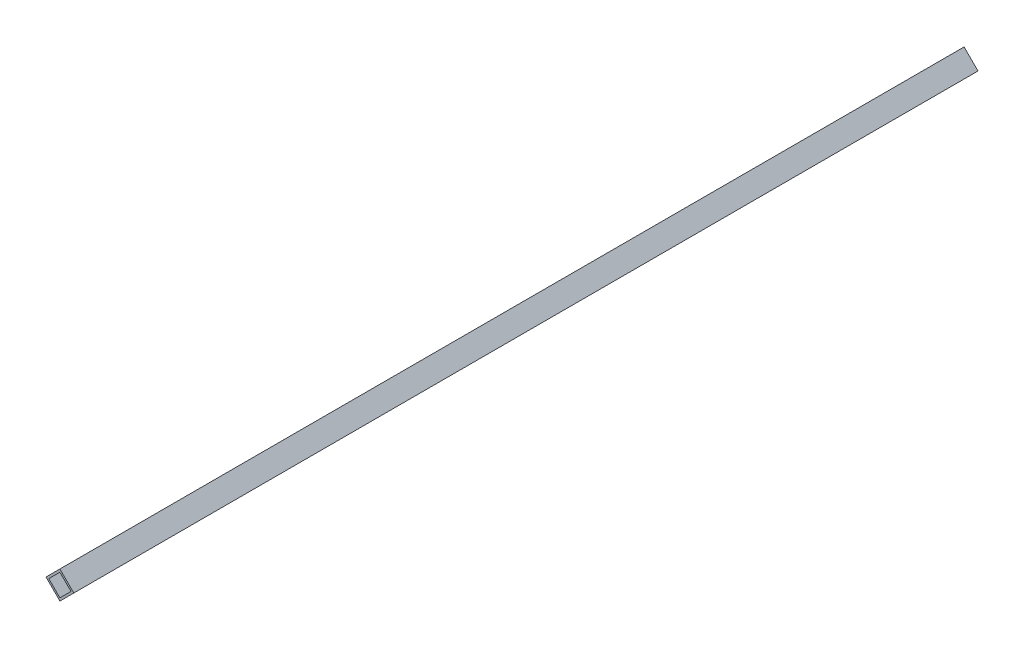
ISO-10303-21;
HEADER;
FILE_DESCRIPTION(('STEP AP214'),'2;1');
FILE_NAME('part.step','',(''),(''),'','','');
FILE_SCHEMA(('AUTOMOTIVE_DESIGN { 1 0 10303 214 1 1 1 1 }'));
ENDSEC;
DATA;
#1=APPLICATION_CONTEXT('core data for automotive mechanical design processes');
#2=APPLICATION_PROTOCOL_DEFINITION('international standard','automotive_design',2000,#1);
#3=PRODUCT_CONTEXT('',#1,'mechanical');
#4=PRODUCT('Part','Part','',(#3));
#5=PRODUCT_RELATED_PRODUCT_CATEGORY('part','',(#4));
#6=PRODUCT_DEFINITION_FORMATION('','',#4);
#7=PRODUCT_DEFINITION_CONTEXT('part definition',#1,'design');
#8=PRODUCT_DEFINITION('design','',#6,#7);
#9=PRODUCT_DEFINITION_SHAPE('','',#8);
#10=(LENGTH_UNIT() NAMED_UNIT(*) SI_UNIT(.MILLI.,.METRE.));
#11=(NAMED_UNIT(*) PLANE_ANGLE_UNIT() SI_UNIT($,.RADIAN.));
#12=(NAMED_UNIT(*) SI_UNIT($,.STERADIAN.) SOLID_ANGLE_UNIT());
#13=UNCERTAINTY_MEASURE_WITH_UNIT(LENGTH_MEASURE(1.E-05),#10,'distance_accuracy_value','');
#14=(GEOMETRIC_REPRESENTATION_CONTEXT(3) GLOBAL_UNCERTAINTY_ASSIGNED_CONTEXT((#13)) GLOBAL_UNIT_ASSIGNED_CONTEXT((#10,
#11,#12)) REPRESENTATION_CONTEXT('',''));
#15=CARTESIAN_POINT('',(0.,0.,0.));
#16=DIRECTION('',(0.,0.,1.));
#17=DIRECTION('',(1.,0.,0.));
#18=AXIS2_PLACEMENT_3D('',#15,#16,#17);
#19=CARTESIAN_POINT('',(0.,0.,230.));
#20=DIRECTION('',(0.,0.,1.));
#21=DIRECTION('',(1.,0.,0.));
#22=AXIS2_PLACEMENT_3D('',#19,#20,#21);
#23=PLANE('',#22);
#24=DIRECTION('',(0.707106781186548,-0.707106781186547,0.));
#25=VECTOR('',#24,1.);
#26=CARTESIAN_POINT('',(-7.07106781186547,0.,230.));
#27=LINE('',#26,#25);
#28=CARTESIAN_POINT('',(-7.07106781186547,0.,230.));
#29=VERTEX_POINT('',#28);
#30=CARTESIAN_POINT('',(0.,-7.07106781186548,230.));
#31=VERTEX_POINT('',#30);
#32=EDGE_CURVE('E160',#29,#31,#27,.T.);
#33=ORIENTED_EDGE('',*,*,#32,.T.);
#34=DIRECTION('',(0.707106781186547,0.707106781186548,0.));
#35=VECTOR('',#34,1.);
#36=CARTESIAN_POINT('',(0.,-7.07106781186548,230.));
#37=LINE('',#36,#35);
#38=CARTESIAN_POINT('',(7.07106781186548,0.,230.));
#39=VERTEX_POINT('',#38);
#40=EDGE_CURVE('E163',#31,#39,#37,.T.);
#41=ORIENTED_EDGE('',*,*,#40,.T.);
#42=DIRECTION('',(-0.707106781186548,0.707106781186547,0.));
#43=VECTOR('',#42,1.);
#44=CARTESIAN_POINT('',(7.07106781186548,0.,230.));
#45=LINE('',#44,#43);
#46=CARTESIAN_POINT('',(0.,7.07106781186548,230.));
#47=VERTEX_POINT('',#46);
#48=EDGE_CURVE('E166',#39,#47,#45,.T.);
#49=ORIENTED_EDGE('',*,*,#48,.T.);
#50=DIRECTION('',(-0.707106781186547,-0.707106781186548,0.));
#51=VECTOR('',#50,1.);
#52=CARTESIAN_POINT('',(0.,7.07106781186548,230.));
#53=LINE('',#52,#51);
#54=EDGE_CURVE('E168',#47,#29,#53,.T.);
#55=ORIENTED_EDGE('',*,*,#54,.T.);
#56=EDGE_LOOP('',(#33,#41,#49,#55));
#57=FACE_BOUND('',#56,.T.);
#58=DIRECTION('',(0.707106781186547,0.707106781186548,0.));
#59=VECTOR('',#58,1.);
#60=CARTESIAN_POINT('',(-0.707106781186546,-6.36396103067893,230.));
#61=LINE('',#60,#59);
#62=CARTESIAN_POINT('',(0.,-5.65685424949238,230.));
#63=VERTEX_POINT('',#62);
#64=CARTESIAN_POINT('',(5.65685424949238,0.,230.));
#65=VERTEX_POINT('',#64);
#66=EDGE_CURVE('E132',#63,#65,#61,.T.);
#67=ORIENTED_EDGE('',*,*,#66,.F.);
#68=DIRECTION('',(0.707106781186548,-0.707106781186547,0.));
#69=VECTOR('',#68,1.);
#70=CARTESIAN_POINT('',(-6.36396103067892,0.707106781186545,230.));
#71=LINE('',#70,#69);
#72=CARTESIAN_POINT('',(-5.65685424949238,0.,230.));
#73=VERTEX_POINT('',#72);
#74=EDGE_CURVE('E124',#73,#63,#71,.T.);
#75=ORIENTED_EDGE('',*,*,#74,.F.);
#76=DIRECTION('',(-0.707106781186547,-0.707106781186548,0.));
#77=VECTOR('',#76,1.);
#78=CARTESIAN_POINT('',(0.707106781186548,6.36396103067893,230.));
#79=LINE('',#78,#77);
#80=CARTESIAN_POINT('',(0.,5.65685424949238,230.));
#81=VERTEX_POINT('',#80);
#82=EDGE_CURVE('E146',#81,#73,#79,.T.);
#83=ORIENTED_EDGE('',*,*,#82,.F.);
#84=DIRECTION('',(-0.707106781186548,0.707106781186547,0.));
#85=VECTOR('',#84,1.);
#86=CARTESIAN_POINT('',(6.36396103067893,-0.707106781186545,230.));
#87=LINE('',#86,#85);
#88=EDGE_CURVE('E144',#65,#81,#87,.T.);
#89=ORIENTED_EDGE('',*,*,#88,.F.);
#90=EDGE_LOOP('',(#67,#75,#83,#89));
#91=FACE_BOUND('',#90,.T.);
#92=ADVANCED_FACE('F59',(#57,#91),#23,.T.);
#93=CARTESIAN_POINT('',(0.,0.,-230.));
#94=DIRECTION('',(0.,0.,1.));
#95=DIRECTION('',(1.,0.,0.));
#96=AXIS2_PLACEMENT_3D('',#93,#94,#95);
#97=PLANE('',#96);
#98=DIRECTION('',(0.707106781186548,-0.707106781186547,0.));
#99=VECTOR('',#98,1.);
#100=CARTESIAN_POINT('',(-7.07106781186547,0.,-230.));
#101=LINE('',#100,#99);
#102=CARTESIAN_POINT('',(-7.07106781186547,0.,-230.));
#103=VERTEX_POINT('',#102);
#104=CARTESIAN_POINT('',(0.,-7.07106781186548,-230.));
#105=VERTEX_POINT('',#104);
#106=EDGE_CURVE('E140',#103,#105,#101,.T.);
#107=ORIENTED_EDGE('',*,*,#106,.F.);
#108=DIRECTION('',(-0.707106781186547,-0.707106781186548,0.));
#109=VECTOR('',#108,1.);
#110=CARTESIAN_POINT('',(0.,7.07106781186548,-230.));
#111=LINE('',#110,#109);
#112=CARTESIAN_POINT('',(0.,7.07106781186548,-230.));
#113=VERTEX_POINT('',#112);
#114=EDGE_CURVE('E164',#113,#103,#111,.T.);
#115=ORIENTED_EDGE('',*,*,#114,.F.);
#116=DIRECTION('',(-0.707106781186548,0.707106781186547,0.));
#117=VECTOR('',#116,1.);
#118=CARTESIAN_POINT('',(7.07106781186548,0.,-230.));
#119=LINE('',#118,#117);
#120=CARTESIAN_POINT('',(7.07106781186548,0.,-230.));
#121=VERTEX_POINT('',#120);
#122=EDGE_CURVE('E175',#121,#113,#119,.T.);
#123=ORIENTED_EDGE('',*,*,#122,.F.);
#124=DIRECTION('',(0.707106781186547,0.707106781186548,0.));
#125=VECTOR('',#124,1.);
#126=CARTESIAN_POINT('',(0.,-7.07106781186548,-230.));
#127=LINE('',#126,#125);
#128=EDGE_CURVE('E173',#105,#121,#127,.T.);
#129=ORIENTED_EDGE('',*,*,#128,.F.);
#130=EDGE_LOOP('',(#107,#115,#123,#129));
#131=FACE_BOUND('',#130,.T.);
#132=DIRECTION('',(0.707106781186548,-0.707106781186547,0.));
#133=VECTOR('',#132,1.);
#134=CARTESIAN_POINT('',(-6.36396103067892,0.707106781186545,-230.));
#135=LINE('',#134,#133);
#136=CARTESIAN_POINT('',(-5.65685424949238,0.,-230.));
#137=VERTEX_POINT('',#136);
#138=CARTESIAN_POINT('',(0.,-5.65685424949238,-230.));
#139=VERTEX_POINT('',#138);
#140=EDGE_CURVE('E82',#137,#139,#135,.T.);
#141=ORIENTED_EDGE('',*,*,#140,.T.);
#142=DIRECTION('',(0.707106781186547,0.707106781186548,0.));
#143=VECTOR('',#142,1.);
#144=CARTESIAN_POINT('',(-0.707106781186546,-6.36396103067893,-230.));
#145=LINE('',#144,#143);
#146=CARTESIAN_POINT('',(5.65685424949238,0.,-230.));
#147=VERTEX_POINT('',#146);
#148=EDGE_CURVE('E139',#139,#147,#145,.T.);
#149=ORIENTED_EDGE('',*,*,#148,.T.);
#150=DIRECTION('',(-0.707106781186548,0.707106781186547,0.));
#151=VECTOR('',#150,1.);
#152=CARTESIAN_POINT('',(6.36396103067893,-0.707106781186545,-230.));
#153=LINE('',#152,#151);
#154=CARTESIAN_POINT('',(0.,5.65685424949238,-230.));
#155=VERTEX_POINT('',#154);
#156=EDGE_CURVE('E152',#147,#155,#153,.T.);
#157=ORIENTED_EDGE('',*,*,#156,.T.);
#158=DIRECTION('',(-0.707106781186547,-0.707106781186548,0.));
#159=VECTOR('',#158,1.);
#160=CARTESIAN_POINT('',(0.707106781186548,6.36396103067893,-230.));
#161=LINE('',#160,#159);
#162=EDGE_CURVE('E133',#155,#137,#161,.T.);
#163=ORIENTED_EDGE('',*,*,#162,.T.);
#164=EDGE_LOOP('',(#141,#149,#157,#163));
#165=FACE_BOUND('',#164,.T.);
#166=ADVANCED_FACE('F193',(#131,#165),#97,.F.);
#167=CARTESIAN_POINT('',(-7.07106781186547,0.,230.));
#168=DIRECTION('',(0.707106781186547,0.707106781186548,0.));
#169=DIRECTION('',(-0.707106781186548,0.707106781186547,0.));
#170=AXIS2_PLACEMENT_3D('',#167,#168,#169);
#171=PLANE('',#170);
#172=ORIENTED_EDGE('',*,*,#106,.T.);
#173=DIRECTION('',(0.,0.,-1.));
#174=VECTOR('',#173,1.);
#175=CARTESIAN_POINT('',(0.,-7.07106781186548,230.));
#176=LINE('',#175,#174);
#177=EDGE_CURVE('E12',#31,#105,#176,.T.);
#178=ORIENTED_EDGE('',*,*,#177,.F.);
#179=ORIENTED_EDGE('',*,*,#32,.F.);
#180=DIRECTION('',(0.,0.,-1.));
#181=VECTOR('',#180,1.);
#182=CARTESIAN_POINT('',(-7.07106781186547,0.,230.));
#183=LINE('',#182,#181);
#184=EDGE_CURVE('E170',#29,#103,#183,.T.);
#185=ORIENTED_EDGE('',*,*,#184,.T.);
#186=EDGE_LOOP('',(#172,#178,#179,#185));
#187=FACE_BOUND('',#186,.T.);
#188=ADVANCED_FACE('F61',(#187),#171,.F.);
#189=CARTESIAN_POINT('',(0.,-7.07106781186548,230.));
#190=DIRECTION('',(-0.707106781186548,0.707106781186547,0.));
#191=DIRECTION('',(-0.707106781186547,-0.707106781186548,0.));
#192=AXIS2_PLACEMENT_3D('',#189,#190,#191);
#193=PLANE('',#192);
#194=ORIENTED_EDGE('',*,*,#128,.T.);
#195=DIRECTION('',(0.,0.,-1.));
#196=VECTOR('',#195,1.);
#197=CARTESIAN_POINT('',(7.07106781186548,0.,230.));
#198=LINE('',#197,#196);
#199=EDGE_CURVE('E67',#39,#121,#198,.T.);
#200=ORIENTED_EDGE('',*,*,#199,.F.);
#201=ORIENTED_EDGE('',*,*,#40,.F.);
#202=ORIENTED_EDGE('',*,*,#177,.T.);
#203=EDGE_LOOP('',(#194,#200,#201,#202));
#204=FACE_BOUND('',#203,.T.);
#205=ADVANCED_FACE('F203',(#204),#193,.F.);
#206=CARTESIAN_POINT('',(7.07106781186548,0.,230.));
#207=DIRECTION('',(-0.707106781186547,-0.707106781186548,0.));
#208=DIRECTION('',(0.707106781186548,-0.707106781186547,0.));
#209=AXIS2_PLACEMENT_3D('',#206,#207,#208);
#210=PLANE('',#209);
#211=ORIENTED_EDGE('',*,*,#122,.T.);
#212=DIRECTION('',(0.,0.,-1.));
#213=VECTOR('',#212,1.);
#214=CARTESIAN_POINT('',(0.,7.07106781186548,230.));
#215=LINE('',#214,#213);
#216=EDGE_CURVE('E180',#47,#113,#215,.T.);
#217=ORIENTED_EDGE('',*,*,#216,.F.);
#218=ORIENTED_EDGE('',*,*,#48,.F.);
#219=ORIENTED_EDGE('',*,*,#199,.T.);
#220=EDGE_LOOP('',(#211,#217,#218,#219));
#221=FACE_BOUND('',#220,.T.);
#222=ADVANCED_FACE('F187',(#221),#210,.F.);
#223=CARTESIAN_POINT('',(0.,7.07106781186548,230.));
#224=DIRECTION('',(0.707106781186548,-0.707106781186547,0.));
#225=DIRECTION('',(0.707106781186547,0.707106781186548,0.));
#226=AXIS2_PLACEMENT_3D('',#223,#224,#225);
#227=PLANE('',#226);
#228=ORIENTED_EDGE('',*,*,#114,.T.);
#229=ORIENTED_EDGE('',*,*,#184,.F.);
#230=ORIENTED_EDGE('',*,*,#54,.F.);
#231=ORIENTED_EDGE('',*,*,#216,.T.);
#232=EDGE_LOOP('',(#228,#229,#230,#231));
#233=FACE_BOUND('',#232,.T.);
#234=ADVANCED_FACE('F197',(#233),#227,.F.);
#235=CARTESIAN_POINT('',(-6.36396103067892,0.707106781186545,230.));
#236=DIRECTION('',(0.707106781186547,0.707106781186548,0.));
#237=DIRECTION('',(-0.707106781186548,0.707106781186547,0.));
#238=AXIS2_PLACEMENT_3D('',#235,#236,#237);
#239=PLANE('',#238);
#240=ORIENTED_EDGE('',*,*,#140,.F.);
#241=DIRECTION('',(0.,0.,-1.));
#242=VECTOR('',#241,1.);
#243=CARTESIAN_POINT('',(-5.65685424949238,0.,230.));
#244=LINE('',#243,#242);
#245=EDGE_CURVE('E128',#73,#137,#244,.T.);
#246=ORIENTED_EDGE('',*,*,#245,.F.);
#247=ORIENTED_EDGE('',*,*,#74,.T.);
#248=DIRECTION('',(0.,0.,-1.));
#249=VECTOR('',#248,1.);
#250=CARTESIAN_POINT('',(0.,-5.65685424949238,230.));
#251=LINE('',#250,#249);
#252=EDGE_CURVE('E127',#63,#139,#251,.T.);
#253=ORIENTED_EDGE('',*,*,#252,.T.);
#254=EDGE_LOOP('',(#240,#246,#247,#253));
#255=FACE_BOUND('',#254,.T.);
#256=ADVANCED_FACE('F126',(#255),#239,.T.);
#257=CARTESIAN_POINT('',(-0.707106781186546,-6.36396103067893,230.));
#258=DIRECTION('',(-0.707106781186548,0.707106781186547,0.));
#259=DIRECTION('',(-0.707106781186547,-0.707106781186548,0.));
#260=AXIS2_PLACEMENT_3D('',#257,#258,#259);
#261=PLANE('',#260);
#262=ORIENTED_EDGE('',*,*,#148,.F.);
#263=ORIENTED_EDGE('',*,*,#252,.F.);
#264=ORIENTED_EDGE('',*,*,#66,.T.);
#265=DIRECTION('',(0.,0.,-1.));
#266=VECTOR('',#265,1.);
#267=CARTESIAN_POINT('',(5.65685424949238,0.,230.));
#268=LINE('',#267,#266);
#269=EDGE_CURVE('E141',#65,#147,#268,.T.);
#270=ORIENTED_EDGE('',*,*,#269,.T.);
#271=EDGE_LOOP('',(#262,#263,#264,#270));
#272=FACE_BOUND('',#271,.T.);
#273=ADVANCED_FACE('F136',(#272),#261,.T.);
#274=CARTESIAN_POINT('',(6.36396103067893,-0.707106781186545,230.));
#275=DIRECTION('',(-0.707106781186547,-0.707106781186548,0.));
#276=DIRECTION('',(0.707106781186548,-0.707106781186547,0.));
#277=AXIS2_PLACEMENT_3D('',#274,#275,#276);
#278=PLANE('',#277);
#279=ORIENTED_EDGE('',*,*,#156,.F.);
#280=ORIENTED_EDGE('',*,*,#269,.F.);
#281=ORIENTED_EDGE('',*,*,#88,.T.);
#282=DIRECTION('',(0.,0.,-1.));
#283=VECTOR('',#282,1.);
#284=CARTESIAN_POINT('',(0.,5.65685424949238,230.));
#285=LINE('',#284,#283);
#286=EDGE_CURVE('E74',#81,#155,#285,.T.);
#287=ORIENTED_EDGE('',*,*,#286,.T.);
#288=EDGE_LOOP('',(#279,#280,#281,#287));
#289=FACE_BOUND('',#288,.T.);
#290=ADVANCED_FACE('F226',(#289),#278,.T.);
#291=CARTESIAN_POINT('',(0.707106781186548,6.36396103067893,230.));
#292=DIRECTION('',(0.707106781186548,-0.707106781186547,0.));
#293=DIRECTION('',(0.707106781186547,0.707106781186548,0.));
#294=AXIS2_PLACEMENT_3D('',#291,#292,#293);
#295=PLANE('',#294);
#296=ORIENTED_EDGE('',*,*,#162,.F.);
#297=ORIENTED_EDGE('',*,*,#286,.F.);
#298=ORIENTED_EDGE('',*,*,#82,.T.);
#299=ORIENTED_EDGE('',*,*,#245,.T.);
#300=EDGE_LOOP('',(#296,#297,#298,#299));
#301=FACE_BOUND('',#300,.T.);
#302=ADVANCED_FACE('F230',(#301),#295,.T.);
#303=CLOSED_SHELL('',(#92,#166,#188,#205,#222,#234,#256,#273,#290,#302));
#304=MANIFOLD_SOLID_BREP('B2',#303);
#305=ADVANCED_BREP_SHAPE_REPRESENTATION('',(#18,#304),#14);
#306=SHAPE_DEFINITION_REPRESENTATION(#9,#305);
ENDSEC;
END-ISO-10303-21;
